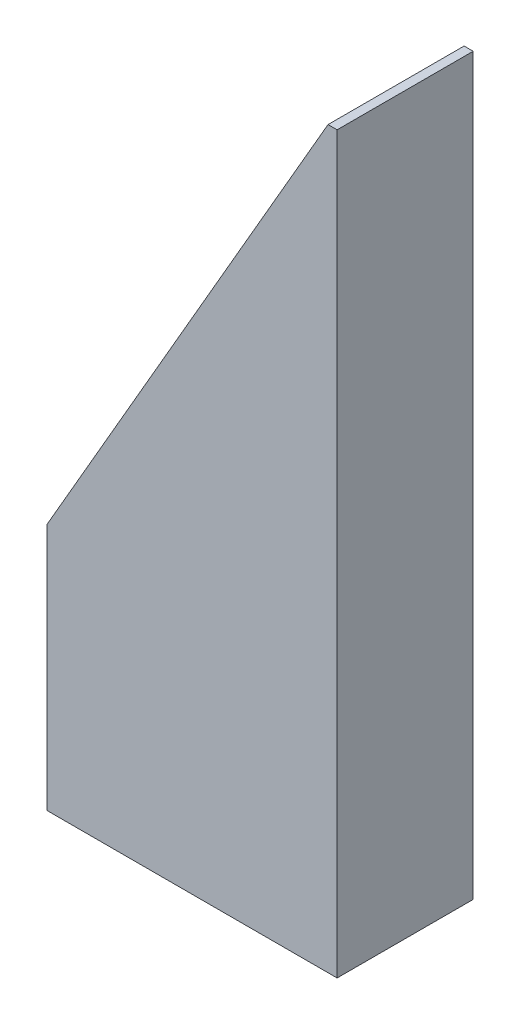
ISO-10303-21;
HEADER;
FILE_DESCRIPTION(('STEP AP214'),'2;1');
FILE_NAME('part.step','',(''),(''),'','','');
FILE_SCHEMA(('AUTOMOTIVE_DESIGN { 1 0 10303 214 1 1 1 1 }'));
ENDSEC;
DATA;
#1=APPLICATION_CONTEXT('core data for automotive mechanical design processes');
#2=APPLICATION_PROTOCOL_DEFINITION('international standard','automotive_design',2000,#1);
#3=PRODUCT_CONTEXT('',#1,'mechanical');
#4=PRODUCT('Part','Part','',(#3));
#5=PRODUCT_RELATED_PRODUCT_CATEGORY('part','',(#4));
#6=PRODUCT_DEFINITION_FORMATION('','',#4);
#7=PRODUCT_DEFINITION_CONTEXT('part definition',#1,'design');
#8=PRODUCT_DEFINITION('design','',#6,#7);
#9=PRODUCT_DEFINITION_SHAPE('','',#8);
#10=(LENGTH_UNIT() NAMED_UNIT(*) SI_UNIT(.MILLI.,.METRE.));
#11=(NAMED_UNIT(*) PLANE_ANGLE_UNIT() SI_UNIT($,.RADIAN.));
#12=(NAMED_UNIT(*) SI_UNIT($,.STERADIAN.) SOLID_ANGLE_UNIT());
#13=UNCERTAINTY_MEASURE_WITH_UNIT(LENGTH_MEASURE(1.E-05),#10,'distance_accuracy_value','');
#14=(GEOMETRIC_REPRESENTATION_CONTEXT(3) GLOBAL_UNCERTAINTY_ASSIGNED_CONTEXT((#13)) GLOBAL_UNIT_ASSIGNED_CONTEXT((#10,
#11,#12)) REPRESENTATION_CONTEXT('',''));
#15=CARTESIAN_POINT('',(0.,0.,0.));
#16=DIRECTION('',(0.,0.,1.));
#17=DIRECTION('',(1.,0.,0.));
#18=AXIS2_PLACEMENT_3D('',#15,#16,#17);
#19=CARTESIAN_POINT('',(0.,0.,15.));
#20=DIRECTION('',(1.,0.,0.));
#21=DIRECTION('',(0.,0.,-1.));
#22=AXIS2_PLACEMENT_3D('',#19,#20,#21);
#23=PLANE('',#22);
#24=DIRECTION('',(0.,-1.,0.));
#25=VECTOR('',#24,1.);
#26=CARTESIAN_POINT('',(0.,0.,0.));
#27=LINE('',#26,#25);
#28=CARTESIAN_POINT('',(0.,27.276424965365,0.));
#29=VERTEX_POINT('',#28);
#30=CARTESIAN_POINT('',(0.,0.,0.));
#31=VERTEX_POINT('',#30);
#32=EDGE_CURVE('E110',#29,#31,#27,.T.);
#33=ORIENTED_EDGE('',*,*,#32,.T.);
#34=DIRECTION('',(0.,0.,-1.));
#35=VECTOR('',#34,1.);
#36=CARTESIAN_POINT('',(0.,0.,15.));
#37=LINE('',#36,#35);
#38=CARTESIAN_POINT('',(0.,0.,15.));
#39=VERTEX_POINT('',#38);
#40=EDGE_CURVE('E11',#39,#31,#37,.T.);
#41=ORIENTED_EDGE('',*,*,#40,.F.);
#42=DIRECTION('',(0.,-1.,0.));
#43=VECTOR('',#42,1.);
#44=CARTESIAN_POINT('',(0.,0.,15.));
#45=LINE('',#44,#43);
#46=CARTESIAN_POINT('',(0.,27.276424965365,15.));
#47=VERTEX_POINT('',#46);
#48=EDGE_CURVE('E118',#47,#39,#45,.T.);
#49=ORIENTED_EDGE('',*,*,#48,.F.);
#50=DIRECTION('',(0.,0.,-1.));
#51=VECTOR('',#50,1.);
#52=CARTESIAN_POINT('',(0.,27.276424965365,15.));
#53=LINE('',#52,#51);
#54=EDGE_CURVE('E106',#47,#29,#53,.T.);
#55=ORIENTED_EDGE('',*,*,#54,.T.);
#56=EDGE_LOOP('',(#33,#41,#49,#55));
#57=FACE_BOUND('',#56,.T.);
#58=ADVANCED_FACE('F36',(#57),#23,.F.);
#59=CARTESIAN_POINT('',(0.,0.,15.));
#60=DIRECTION('',(0.,1.,0.));
#61=DIRECTION('',(0.,0.,1.));
#62=AXIS2_PLACEMENT_3D('',#59,#60,#61);
#63=PLANE('',#62);
#64=DIRECTION('',(1.,0.,0.));
#65=VECTOR('',#64,1.);
#66=CARTESIAN_POINT('',(0.,0.,0.));
#67=LINE('',#66,#65);
#68=CARTESIAN_POINT('',(32.,0.,0.));
#69=VERTEX_POINT('',#68);
#70=EDGE_CURVE('E113',#31,#69,#67,.T.);
#71=ORIENTED_EDGE('',*,*,#70,.T.);
#72=DIRECTION('',(0.,0.,-1.));
#73=VECTOR('',#72,1.);
#74=CARTESIAN_POINT('',(32.,0.,15.));
#75=LINE('',#74,#73);
#76=CARTESIAN_POINT('',(32.,0.,15.));
#77=VERTEX_POINT('',#76);
#78=EDGE_CURVE('E44',#77,#69,#75,.T.);
#79=ORIENTED_EDGE('',*,*,#78,.F.);
#80=DIRECTION('',(1.,0.,0.));
#81=VECTOR('',#80,1.);
#82=CARTESIAN_POINT('',(0.,0.,15.));
#83=LINE('',#82,#81);
#84=EDGE_CURVE('E86',#39,#77,#83,.T.);
#85=ORIENTED_EDGE('',*,*,#84,.F.);
#86=ORIENTED_EDGE('',*,*,#40,.T.);
#87=EDGE_LOOP('',(#71,#79,#85,#86));
#88=FACE_BOUND('',#87,.T.);
#89=ADVANCED_FACE('F137',(#88),#63,.F.);
#90=CARTESIAN_POINT('',(32.,0.,15.));
#91=DIRECTION('',(-1.,0.,0.));
#92=DIRECTION('',(0.,0.,1.));
#93=AXIS2_PLACEMENT_3D('',#90,#91,#92);
#94=PLANE('',#93);
#95=DIRECTION('',(0.,1.,0.));
#96=VECTOR('',#95,1.);
#97=CARTESIAN_POINT('',(32.,0.,0.));
#98=LINE('',#97,#96);
#99=CARTESIAN_POINT('',(32.,80.97,0.));
#100=VERTEX_POINT('',#99);
#101=EDGE_CURVE('E101',#69,#100,#98,.T.);
#102=ORIENTED_EDGE('',*,*,#101,.T.);
#103=DIRECTION('',(0.,0.,-1.));
#104=VECTOR('',#103,1.);
#105=CARTESIAN_POINT('',(32.,80.97,15.));
#106=LINE('',#105,#104);
#107=CARTESIAN_POINT('',(32.,80.97,15.));
#108=VERTEX_POINT('',#107);
#109=EDGE_CURVE('E98',#108,#100,#106,.T.);
#110=ORIENTED_EDGE('',*,*,#109,.F.);
#111=DIRECTION('',(0.,1.,0.));
#112=VECTOR('',#111,1.);
#113=CARTESIAN_POINT('',(32.,0.,15.));
#114=LINE('',#113,#112);
#115=EDGE_CURVE('E90',#77,#108,#114,.T.);
#116=ORIENTED_EDGE('',*,*,#115,.F.);
#117=ORIENTED_EDGE('',*,*,#78,.T.);
#118=EDGE_LOOP('',(#102,#110,#116,#117));
#119=FACE_BOUND('',#118,.T.);
#120=ADVANCED_FACE('F99',(#119),#94,.F.);
#121=CARTESIAN_POINT('',(31.,80.97,15.));
#122=DIRECTION('',(0.,-1.,0.));
#123=DIRECTION('',(0.,0.,-1.));
#124=AXIS2_PLACEMENT_3D('',#121,#122,#123);
#125=PLANE('',#124);
#126=DIRECTION('',(-1.,0.,0.));
#127=VECTOR('',#126,1.);
#128=CARTESIAN_POINT('',(31.,80.97,0.));
#129=LINE('',#128,#127);
#130=CARTESIAN_POINT('',(31.,80.97,0.));
#131=VERTEX_POINT('',#130);
#132=EDGE_CURVE('E72',#100,#131,#129,.T.);
#133=ORIENTED_EDGE('',*,*,#132,.T.);
#134=DIRECTION('',(0.,0.,-1.));
#135=VECTOR('',#134,1.);
#136=CARTESIAN_POINT('',(31.,80.97,15.));
#137=LINE('',#136,#135);
#138=CARTESIAN_POINT('',(31.,80.97,15.));
#139=VERTEX_POINT('',#138);
#140=EDGE_CURVE('E102',#139,#131,#137,.T.);
#141=ORIENTED_EDGE('',*,*,#140,.F.);
#142=DIRECTION('',(-1.,0.,0.));
#143=VECTOR('',#142,1.);
#144=CARTESIAN_POINT('',(31.,80.97,15.));
#145=LINE('',#144,#143);
#146=EDGE_CURVE('E94',#108,#139,#145,.T.);
#147=ORIENTED_EDGE('',*,*,#146,.F.);
#148=ORIENTED_EDGE('',*,*,#109,.T.);
#149=EDGE_LOOP('',(#133,#141,#147,#148));
#150=FACE_BOUND('',#149,.T.);
#151=ADVANCED_FACE('F104',(#150),#125,.F.);
#152=CARTESIAN_POINT('',(0.,27.276424965365,15.));
#153=DIRECTION('',(0.866025403784438,-0.500000000000001,0.));
#154=DIRECTION('',(0.500000000000001,0.866025403784438,0.));
#155=AXIS2_PLACEMENT_3D('',#152,#153,#154);
#156=PLANE('',#155);
#157=DIRECTION('',(-0.500000000000001,-0.866025403784438,0.));
#158=VECTOR('',#157,1.);
#159=CARTESIAN_POINT('',(0.,27.276424965365,0.));
#160=LINE('',#159,#158);
#161=EDGE_CURVE('E78',#131,#29,#160,.T.);
#162=ORIENTED_EDGE('',*,*,#161,.T.);
#163=ORIENTED_EDGE('',*,*,#54,.F.);
#164=DIRECTION('',(-0.500000000000001,-0.866025403784438,0.));
#165=VECTOR('',#164,1.);
#166=CARTESIAN_POINT('',(0.,27.276424965365,15.));
#167=LINE('',#166,#165);
#168=EDGE_CURVE('E52',#139,#47,#167,.T.);
#169=ORIENTED_EDGE('',*,*,#168,.F.);
#170=ORIENTED_EDGE('',*,*,#140,.T.);
#171=EDGE_LOOP('',(#162,#163,#169,#170));
#172=FACE_BOUND('',#171,.T.);
#173=ADVANCED_FACE('F126',(#172),#156,.F.);
#174=CARTESIAN_POINT('',(0.,0.,15.));
#175=DIRECTION('',(0.,0.,-1.));
#176=DIRECTION('',(-1.,0.,0.));
#177=AXIS2_PLACEMENT_3D('',#174,#175,#176);
#178=PLANE('',#177);
#179=ORIENTED_EDGE('',*,*,#48,.T.);
#180=ORIENTED_EDGE('',*,*,#84,.T.);
#181=ORIENTED_EDGE('',*,*,#115,.T.);
#182=ORIENTED_EDGE('',*,*,#146,.T.);
#183=ORIENTED_EDGE('',*,*,#168,.T.);
#184=EDGE_LOOP('',(#179,#180,#181,#182,#183));
#185=FACE_BOUND('',#184,.T.);
#186=ADVANCED_FACE('F92',(#185),#178,.F.);
#187=CARTESIAN_POINT('',(0.,0.,0.));
#188=DIRECTION('',(0.,0.,-1.));
#189=DIRECTION('',(-1.,0.,0.));
#190=AXIS2_PLACEMENT_3D('',#187,#188,#189);
#191=PLANE('',#190);
#192=ORIENTED_EDGE('',*,*,#32,.F.);
#193=ORIENTED_EDGE('',*,*,#161,.F.);
#194=ORIENTED_EDGE('',*,*,#132,.F.);
#195=ORIENTED_EDGE('',*,*,#101,.F.);
#196=ORIENTED_EDGE('',*,*,#70,.F.);
#197=EDGE_LOOP('',(#192,#193,#194,#195,#196));
#198=FACE_BOUND('',#197,.T.);
#199=ADVANCED_FACE('F122',(#198),#191,.T.);
#200=CLOSED_SHELL('',(#58,#89,#120,#151,#173,#186,#199));
#201=MANIFOLD_SOLID_BREP('B2',#200);
#202=ADVANCED_BREP_SHAPE_REPRESENTATION('',(#18,#201),#14);
#203=SHAPE_DEFINITION_REPRESENTATION(#9,#202);
ENDSEC;
END-ISO-10303-21;
